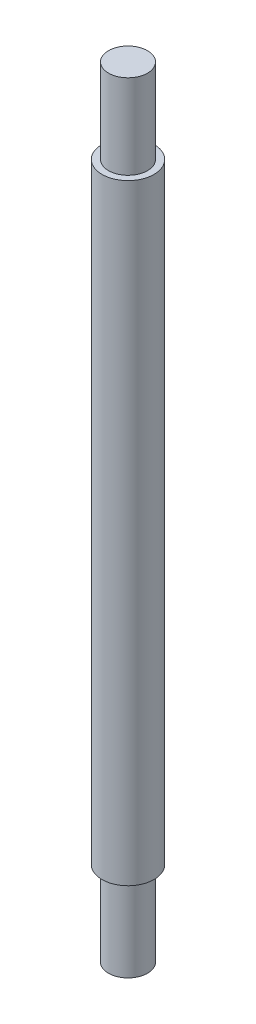
ISO-10303-21;
HEADER;
FILE_DESCRIPTION(('STEP AP214'),'2;1');
FILE_NAME('part.step','',(''),(''),'','','');
FILE_SCHEMA(('AUTOMOTIVE_DESIGN { 1 0 10303 214 1 1 1 1 }'));
ENDSEC;
DATA;
#1=APPLICATION_CONTEXT('core data for automotive mechanical design processes');
#2=APPLICATION_PROTOCOL_DEFINITION('international standard','automotive_design',2000,#1);
#3=PRODUCT_CONTEXT('',#1,'mechanical');
#4=PRODUCT('Part','Part','',(#3));
#5=PRODUCT_RELATED_PRODUCT_CATEGORY('part','',(#4));
#6=PRODUCT_DEFINITION_FORMATION('','',#4);
#7=PRODUCT_DEFINITION_CONTEXT('part definition',#1,'design');
#8=PRODUCT_DEFINITION('design','',#6,#7);
#9=PRODUCT_DEFINITION_SHAPE('','',#8);
#10=(LENGTH_UNIT() NAMED_UNIT(*) SI_UNIT(.MILLI.,.METRE.));
#11=(NAMED_UNIT(*) PLANE_ANGLE_UNIT() SI_UNIT($,.RADIAN.));
#12=(NAMED_UNIT(*) SI_UNIT($,.STERADIAN.) SOLID_ANGLE_UNIT());
#13=UNCERTAINTY_MEASURE_WITH_UNIT(LENGTH_MEASURE(1.E-05),#10,'distance_accuracy_value','');
#14=(GEOMETRIC_REPRESENTATION_CONTEXT(3) GLOBAL_UNCERTAINTY_ASSIGNED_CONTEXT((#13)) GLOBAL_UNIT_ASSIGNED_CONTEXT((#10,
#11,#12)) REPRESENTATION_CONTEXT('',''));
#15=CARTESIAN_POINT('',(0.,0.,0.));
#16=DIRECTION('',(0.,0.,1.));
#17=DIRECTION('',(1.,0.,0.));
#18=AXIS2_PLACEMENT_3D('',#15,#16,#17);
#19=CARTESIAN_POINT('',(0.,30.,0.));
#20=DIRECTION('',(0.,-1.,0.));
#21=DIRECTION('',(0.,0.,-1.));
#22=AXIS2_PLACEMENT_3D('',#19,#20,#21);
#23=PLANE('',#22);
#24=CARTESIAN_POINT('',(0.,30.,0.));
#25=DIRECTION('',(0.,-1.,0.));
#26=DIRECTION('',(0.,0.,-1.));
#27=AXIS2_PLACEMENT_3D('',#24,#25,#26);
#28=CIRCLE('',#27,1.5);
#29=CARTESIAN_POINT('',(0.,30.,-1.5));
#30=VERTEX_POINT('',#29);
#31=EDGE_CURVE('E17',#30,#30,#28,.T.);
#32=ORIENTED_EDGE('',*,*,#31,.F.);
#33=EDGE_LOOP('',(#32));
#34=FACE_BOUND('',#33,.T.);
#35=ADVANCED_FACE('F14',(#34),#23,.F.);
#36=CARTESIAN_POINT('',(0.,-30.,0.));
#37=DIRECTION('',(0.,-1.,0.));
#38=DIRECTION('',(0.,0.,-1.));
#39=AXIS2_PLACEMENT_3D('',#36,#37,#38);
#40=PLANE('',#39);
#41=CARTESIAN_POINT('',(0.,-30.,0.));
#42=DIRECTION('',(0.,-1.,0.));
#43=DIRECTION('',(0.,0.,-1.));
#44=AXIS2_PLACEMENT_3D('',#41,#42,#43);
#45=CIRCLE('',#44,1.5);
#46=CARTESIAN_POINT('',(0.,-30.,-1.5));
#47=VERTEX_POINT('',#46);
#48=EDGE_CURVE('E33',#47,#47,#45,.F.);
#49=ORIENTED_EDGE('',*,*,#48,.F.);
#50=EDGE_LOOP('',(#49));
#51=FACE_BOUND('',#50,.T.);
#52=ADVANCED_FACE('F44',(#51),#40,.T.);
#53=CARTESIAN_POINT('',(0.,33.,0.));
#54=DIRECTION('',(0.,-1.,0.));
#55=DIRECTION('',(0.,0.,-1.));
#56=AXIS2_PLACEMENT_3D('',#53,#54,#55);
#57=CYLINDRICAL_SURFACE('',#56,1.5);
#58=ORIENTED_EDGE('',*,*,#31,.T.);
#59=EDGE_LOOP('',(#58));
#60=FACE_BOUND('',#59,.T.);
#61=CARTESIAN_POINT('',(0.,23.5,0.));
#62=DIRECTION('',(0.,-1.,0.));
#63=DIRECTION('',(0.,0.,-1.));
#64=AXIS2_PLACEMENT_3D('',#61,#62,#63);
#65=CIRCLE('',#64,1.5);
#66=CARTESIAN_POINT('',(0.,23.5,-1.5));
#67=VERTEX_POINT('',#66);
#68=EDGE_CURVE('E31',#67,#67,#65,.F.);
#69=ORIENTED_EDGE('',*,*,#68,.T.);
#70=EDGE_LOOP('',(#69));
#71=FACE_BOUND('',#70,.T.);
#72=ADVANCED_FACE('F40',(#60,#71),#57,.T.);
#73=CARTESIAN_POINT('',(0.,33.,0.));
#74=DIRECTION('',(0.,-1.,0.));
#75=DIRECTION('',(0.,0.,-1.));
#76=AXIS2_PLACEMENT_3D('',#73,#74,#75);
#77=CYLINDRICAL_SURFACE('',#76,1.5);
#78=CARTESIAN_POINT('',(0.,-23.5,0.));
#79=DIRECTION('',(0.,-1.,0.));
#80=DIRECTION('',(0.,0.,-1.));
#81=AXIS2_PLACEMENT_3D('',#78,#79,#80);
#82=CIRCLE('',#81,1.5);
#83=CARTESIAN_POINT('',(0.,-23.5,-1.5));
#84=VERTEX_POINT('',#83);
#85=EDGE_CURVE('E26',#84,#84,#82,.F.);
#86=ORIENTED_EDGE('',*,*,#85,.F.);
#87=EDGE_LOOP('',(#86));
#88=FACE_BOUND('',#87,.T.);
#89=ORIENTED_EDGE('',*,*,#48,.T.);
#90=EDGE_LOOP('',(#89));
#91=FACE_BOUND('',#90,.T.);
#92=ADVANCED_FACE('F64',(#88,#91),#77,.T.);
#93=CARTESIAN_POINT('',(0.,23.5,0.));
#94=DIRECTION('',(0.,-1.,0.));
#95=DIRECTION('',(0.,0.,-1.));
#96=AXIS2_PLACEMENT_3D('',#93,#94,#95);
#97=PLANE('',#96);
#98=ORIENTED_EDGE('',*,*,#68,.F.);
#99=EDGE_LOOP('',(#98));
#100=FACE_BOUND('',#99,.T.);
#101=CARTESIAN_POINT('',(0.,23.5,0.));
#102=DIRECTION('',(0.,-1.,0.));
#103=DIRECTION('',(0.,0.,-1.));
#104=AXIS2_PLACEMENT_3D('',#101,#102,#103);
#105=CIRCLE('',#104,2.);
#106=CARTESIAN_POINT('',(0.,23.5,-2.));
#107=VERTEX_POINT('',#106);
#108=EDGE_CURVE('E21',#107,#107,#105,.T.);
#109=ORIENTED_EDGE('',*,*,#108,.F.);
#110=EDGE_LOOP('',(#109));
#111=FACE_BOUND('',#110,.T.);
#112=ADVANCED_FACE('F57',(#100,#111),#97,.F.);
#113=CARTESIAN_POINT('',(0.,-23.5,0.));
#114=DIRECTION('',(0.,-1.,0.));
#115=DIRECTION('',(0.,0.,-1.));
#116=AXIS2_PLACEMENT_3D('',#113,#114,#115);
#117=PLANE('',#116);
#118=ORIENTED_EDGE('',*,*,#85,.T.);
#119=EDGE_LOOP('',(#118));
#120=FACE_BOUND('',#119,.T.);
#121=CARTESIAN_POINT('',(0.,-23.5,0.));
#122=DIRECTION('',(0.,-1.,0.));
#123=DIRECTION('',(0.,0.,-1.));
#124=AXIS2_PLACEMENT_3D('',#121,#122,#123);
#125=CIRCLE('',#124,2.);
#126=CARTESIAN_POINT('',(0.,-23.5,-2.));
#127=VERTEX_POINT('',#126);
#128=EDGE_CURVE('E10',#127,#127,#125,.F.);
#129=ORIENTED_EDGE('',*,*,#128,.F.);
#130=EDGE_LOOP('',(#129));
#131=FACE_BOUND('',#130,.T.);
#132=ADVANCED_FACE('F52',(#120,#131),#117,.T.);
#133=CARTESIAN_POINT('',(0.,33.,0.));
#134=DIRECTION('',(0.,-1.,0.));
#135=DIRECTION('',(0.,0.,-1.));
#136=AXIS2_PLACEMENT_3D('',#133,#134,#135);
#137=CYLINDRICAL_SURFACE('',#136,2.);
#138=ORIENTED_EDGE('',*,*,#128,.T.);
#139=EDGE_LOOP('',(#138));
#140=FACE_BOUND('',#139,.T.);
#141=ORIENTED_EDGE('',*,*,#108,.T.);
#142=EDGE_LOOP('',(#141));
#143=FACE_BOUND('',#142,.T.);
#144=ADVANCED_FACE('F50',(#140,#143),#137,.T.);
#145=CLOSED_SHELL('',(#35,#52,#72,#92,#112,#132,#144));
#146=MANIFOLD_SOLID_BREP('B1',#145);
#147=ADVANCED_BREP_SHAPE_REPRESENTATION('',(#18,#146),#14);
#148=SHAPE_DEFINITION_REPRESENTATION(#9,#147);
ENDSEC;
END-ISO-10303-21;
